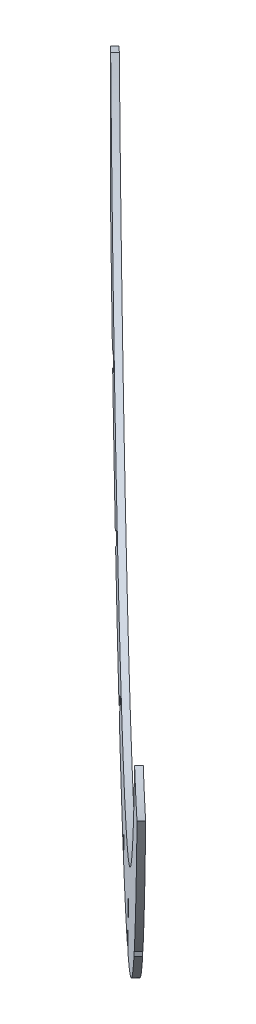
ISO-10303-21;
HEADER;
FILE_DESCRIPTION(('STEP AP214'),'2;1');
FILE_NAME('part.step','',(''),(''),'','','');
FILE_SCHEMA(('AUTOMOTIVE_DESIGN { 1 0 10303 214 1 1 1 1 }'));
ENDSEC;
DATA;
#1=APPLICATION_CONTEXT('core data for automotive mechanical design processes');
#2=APPLICATION_PROTOCOL_DEFINITION('international standard','automotive_design',2000,#1);
#3=PRODUCT_CONTEXT('',#1,'mechanical');
#4=PRODUCT('Part','Part','',(#3));
#5=PRODUCT_RELATED_PRODUCT_CATEGORY('part','',(#4));
#6=PRODUCT_DEFINITION_FORMATION('','',#4);
#7=PRODUCT_DEFINITION_CONTEXT('part definition',#1,'design');
#8=PRODUCT_DEFINITION('design','',#6,#7);
#9=PRODUCT_DEFINITION_SHAPE('','',#8);
#10=(LENGTH_UNIT() NAMED_UNIT(*) SI_UNIT(.MILLI.,.METRE.));
#11=(NAMED_UNIT(*) PLANE_ANGLE_UNIT() SI_UNIT($,.RADIAN.));
#12=(NAMED_UNIT(*) SI_UNIT($,.STERADIAN.) SOLID_ANGLE_UNIT());
#13=UNCERTAINTY_MEASURE_WITH_UNIT(LENGTH_MEASURE(1.E-05),#10,'distance_accuracy_value','');
#14=(GEOMETRIC_REPRESENTATION_CONTEXT(3) GLOBAL_UNCERTAINTY_ASSIGNED_CONTEXT((#13)) GLOBAL_UNIT_ASSIGNED_CONTEXT((#10,
#11,#12)) REPRESENTATION_CONTEXT('',''));
#15=CARTESIAN_POINT('',(0.,0.,0.));
#16=DIRECTION('',(0.,0.,1.));
#17=DIRECTION('',(1.,0.,0.));
#18=AXIS2_PLACEMENT_3D('',#15,#16,#17);
#19=CARTESIAN_POINT('',(-161.990390566707,0.,168.265005002207));
#20=DIRECTION('',(-0.693547097638021,0.,0.720411287639136));
#21=DIRECTION('',(0.720411287639136,0.,0.693547097638021));
#22=AXIS2_PLACEMENT_3D('',#19,#20,#21);
#23=PLANE('',#22);
#24=DIRECTION('',(0.,1.,0.));
#25=VECTOR('',#24,1.);
#26=CARTESIAN_POINT('',(-334.662345491773,0.,2.03200000000001));
#27=LINE('',#26,#25);
#28=CARTESIAN_POINT('',(-334.662345491773,-173.506150768829,2.03200000000003));
#29=VERTEX_POINT('',#28);
#30=CARTESIAN_POINT('',(-334.662345491773,-109.465312352597,2.03200000000001));
#31=VERTEX_POINT('',#30);
#32=EDGE_CURVE('E250',#29,#31,#27,.T.);
#33=ORIENTED_EDGE('',*,*,#32,.T.);
#34=DIRECTION('',(0.701450777031491,0.227915173395406,0.675293625868081));
#35=VECTOR('',#34,1.);
#36=CARTESIAN_POINT('',(-153.459532495777,-50.5889493973902,176.477746747058));
#37=LINE('',#36,#35);
#38=CARTESIAN_POINT('',(-330.156120633245,-108.001151140407,6.37018740150313));
#39=VERTEX_POINT('',#38);
#40=EDGE_CURVE('E45',#31,#39,#37,.T.);
#41=ORIENTED_EDGE('',*,*,#40,.T.);
#42=CARTESIAN_POINT('',(-161.990390566707,0.,168.265005002207));
#43=DIRECTION('',(-0.693547097638021,0.,0.720411287639136));
#44=DIRECTION('',(0.720411287639136,0.,0.693547097638021));
#45=AXIS2_PLACEMENT_3D('',#42,#43,#44);
#46=CIRCLE('',#45,257.203991770015);
#47=CARTESIAN_POINT('',(8.28892702871723,-101.419609224618,332.194594297101));
#48=VERTEX_POINT('',#47);
#49=EDGE_CURVE('E241',#39,#48,#46,.T.);
#50=ORIENTED_EDGE('',*,*,#49,.T.);
#51=CARTESIAN_POINT('',(2.23724422756069,0.,326.368579193531));
#52=DIRECTION('',(-0.693547097638021,0.,0.720411287639136));
#53=DIRECTION('',(-0.720411287639136,0.,-0.693547097638021));
#54=AXIS2_PLACEMENT_3D('',#51,#52,#53);
#55=ELLIPSE('',#54,141.030549830714,101.6);
#56=CARTESIAN_POINT('',(42.2400086222768,-93.3934625162856,364.879637556278));
#57=VERTEX_POINT('',#56);
#58=EDGE_CURVE('E344',#57,#48,#55,.F.);
#59=ORIENTED_EDGE('',*,*,#58,.F.);
#60=CARTESIAN_POINT('',(-161.990390566707,0.,168.265005002207));
#61=DIRECTION('',(-0.693547097638021,0.,0.720411287639136));
#62=DIRECTION('',(0.720411287639136,0.,0.693547097638021));
#63=AXIS2_PLACEMENT_3D('',#60,#61,#62);
#64=CIRCLE('',#63,298.478991770015);
#65=CARTESIAN_POINT('',(2.87453446913316,-191.619798668164,326.982104835035));
#66=VERTEX_POINT('',#65);
#67=EDGE_CURVE('E829',#66,#57,#64,.T.);
#68=ORIENTED_EDGE('',*,*,#67,.F.);
#69=DIRECTION('',(0.,1.,0.));
#70=VECTOR('',#69,1.);
#71=CARTESIAN_POINT('',(2.87453446913319,0.,326.982104835035));
#72=LINE('',#71,#70);
#73=CARTESIAN_POINT('',(2.87453446913319,-152.657080758462,326.982104835035));
#74=VERTEX_POINT('',#73);
#75=EDGE_CURVE('E689',#66,#74,#72,.T.);
#76=ORIENTED_EDGE('',*,*,#75,.T.);
#77=DIRECTION('',(-0.46940785733499,-0.758577218478036,-0.451903603745643));
#78=VECTOR('',#77,1.);
#79=CARTESIAN_POINT('',(-12.7621626909497,-177.926453762191,311.928501264275));
#80=LINE('',#79,#78);
#81=CARTESIAN_POINT('',(-0.637290241572108,-158.332295135899,323.601236326568));
#82=VERTEX_POINT('',#81);
#83=EDGE_CURVE('E693',#74,#82,#80,.T.);
#84=ORIENTED_EDGE('',*,*,#83,.T.);
#85=DIRECTION('',(0.,-1.,0.));
#86=VECTOR('',#85,1.);
#87=CARTESIAN_POINT('',(-0.637290241572053,0.,323.601236326568));
#88=LINE('',#87,#86);
#89=CARTESIAN_POINT('',(-0.637290241572025,-197.295567059821,323.601236326568));
#90=VERTEX_POINT('',#89);
#91=EDGE_CURVE('E695',#82,#90,#88,.T.);
#92=ORIENTED_EDGE('',*,*,#91,.T.);
#93=CARTESIAN_POINT('',(-88.5845045240809,-280.548100883959,238.933580145233));
#94=VERTEX_POINT('',#93);
#95=EDGE_CURVE('E831',#94,#90,#64,.T.);
#96=ORIENTED_EDGE('',*,*,#95,.F.);
#97=DIRECTION('',(-0.296188126760783,-0.911573321638448,-0.285143249688616));
#98=VECTOR('',#97,1.);
#99=CARTESIAN_POINT('',(-25.2454007122821,-85.6103838229504,299.910764108612));
#100=LINE('',#99,#98);
#101=CARTESIAN_POINT('',(-78.1700446466156,-248.495689170512,248.959684046456));
#102=VERTEX_POINT('',#101);
#103=EDGE_CURVE('E713',#102,#94,#100,.T.);
#104=ORIENTED_EDGE('',*,*,#103,.F.);
#105=DIRECTION('',(0.679204873038526,0.333354543896063,0.65387727327425));
#106=VECTOR('',#105,1.);
#107=CARTESIAN_POINT('',(-96.412425929923,-257.449071181848,231.397562505432));
#108=LINE('',#107,#106);
#109=CARTESIAN_POINT('',(-81.6261467469088,-250.191948112453,245.632460248153));
#110=VERTEX_POINT('',#109);
#111=EDGE_CURVE('E711',#110,#102,#108,.T.);
#112=ORIENTED_EDGE('',*,*,#111,.F.);
#113=DIRECTION('',(0.296188126760783,0.911573321638448,0.285143249688616));
#114=VECTOR('',#113,1.);
#115=CARTESIAN_POINT('',(-27.6593186206254,-84.0991296346225,297.586861376946));
#116=LINE('',#115,#114);
#117=CARTESIAN_POINT('',(-92.0406066243741,-282.2443598259,235.606356346931));
#118=VERTEX_POINT('',#117);
#119=EDGE_CURVE('E709',#118,#110,#116,.T.);
#120=ORIENTED_EDGE('',*,*,#119,.F.);
#121=CARTESIAN_POINT('',(-148.869926078573,-297.922833449937,180.896206402768));
#122=VERTEX_POINT('',#121);
#123=EDGE_CURVE('E258',#122,#118,#64,.T.);
#124=ORIENTED_EDGE('',*,*,#123,.F.);
#125=DIRECTION('',(-0.415993734480624,-0.816433673516012,-0.40048129746845));
#126=VECTOR('',#125,1.);
#127=CARTESIAN_POINT('',(-52.060844940478,-107.924313780006,274.095269771639));
#128=LINE('',#127,#126);
#129=CARTESIAN_POINT('',(-138.551072224335,-277.670942470836,190.830269436415));
#130=VERTEX_POINT('',#129);
#131=EDGE_CURVE('E678',#130,#122,#128,.T.);
#132=ORIENTED_EDGE('',*,*,#131,.F.);
#133=DIRECTION('',(0.588168034009613,-0.577439223424566,0.566235204680971));
#134=VECTOR('',#133,1.);
#135=CARTESIAN_POINT('',(-248.480617850565,-169.746628690825,85.0000046669825));
#136=LINE('',#135,#134);
#137=CARTESIAN_POINT('',(-140.964990132678,-275.301056992868,188.506366704749));
#138=VERTEX_POINT('',#137);
#139=EDGE_CURVE('E676',#138,#130,#136,.T.);
#140=ORIENTED_EDGE('',*,*,#139,.F.);
#141=DIRECTION('',(0.415993734480622,0.816433673516014,0.400481297468449));
#142=VECTOR('',#141,1.);
#143=CARTESIAN_POINT('',(-54.4747628488212,-105.554428302037,271.771367039973));
#144=LINE('',#143,#142);
#145=CARTESIAN_POINT('',(-152.63059266156,-298.1960910691,177.275775353774));
#146=VERTEX_POINT('',#145);
#147=EDGE_CURVE('E674',#146,#138,#144,.T.);
#148=ORIENTED_EDGE('',*,*,#147,.F.);
#149=CARTESIAN_POINT('',(-208.230950592468,-291.49583696271,123.748758867142));
#150=VERTEX_POINT('',#149);
#151=EDGE_CURVE('E257',#150,#146,#64,.T.);
#152=ORIENTED_EDGE('',*,*,#151,.F.);
#153=DIRECTION('',(-0.511561649630656,-0.704104205758047,-0.49248547802041));
#154=VECTOR('',#153,1.);
#155=CARTESIAN_POINT('',(-79.9200617798868,-114.891049401486,247.274925181038));
#156=LINE('',#155,#154);
#157=CARTESIAN_POINT('',(-192.861249167201,-270.341257797934,138.54532299371));
#158=VERTEX_POINT('',#157);
#159=EDGE_CURVE('E730',#158,#150,#156,.T.);
#160=ORIENTED_EDGE('',*,*,#159,.F.);
#161=DIRECTION('',(0.702064563395524,-0.224244194830839,0.67588452409337));
#162=VECTOR('',#161,1.);
#163=CARTESIAN_POINT('',(-206.103625144743,-266.111552876824,125.796756192165));
#164=LINE('',#163,#162);
#165=CARTESIAN_POINT('',(-196.813239168247,-269.078965322328,134.740702991015));
#166=VERTEX_POINT('',#165);
#167=EDGE_CURVE('E728',#166,#158,#164,.T.);
#168=ORIENTED_EDGE('',*,*,#167,.F.);
#169=DIRECTION('',(0.511561649630656,0.704104205758047,0.492485478020411));
#170=VECTOR('',#169,1.);
#171=CARTESIAN_POINT('',(-82.3339796882299,-111.511782305104,244.951022449372));
#172=LINE('',#171,#170);
#173=CARTESIAN_POINT('',(-212.182940593513,-290.233544487104,119.944138864446));
#174=VERTEX_POINT('',#173);
#175=EDGE_CURVE('E726',#174,#166,#172,.T.);
#176=ORIENTED_EDGE('',*,*,#175,.F.);
#177=CARTESIAN_POINT('',(-260.035404079115,-265.64566239674,73.8760972683336));
#178=VERTEX_POINT('',#177);
#179=EDGE_CURVE('E253',#178,#174,#64,.T.);
#180=ORIENTED_EDGE('',*,*,#179,.F.);
#181=CARTESIAN_POINT('',(-260.035404079115,-265.64566239674,73.8760972683336));
#182=CARTESIAN_POINT('',(-261.993265554872,-264.25332744598,71.9912445912772));
#183=CARTESIAN_POINT('',(-263.921450708035,-262.790832152815,70.1349616045577));
#184=CARTESIAN_POINT('',(-267.731917031048,-259.757316017976,66.4665878515123));
#185=CARTESIAN_POINT('',(-269.613974484562,-258.185766269304,64.6547124591236));
#186=CARTESIAN_POINT('',(-273.338171583193,-254.948293653579,61.0693909447262));
#187=CARTESIAN_POINT('',(-275.182185242131,-253.280304754892,59.2941406910097));
#188=CARTESIAN_POINT('',(-278.819523708239,-249.871314445755,55.7924388443283));
#189=CARTESIAN_POINT('',(-280.613835541035,-248.129506052597,54.065037031995));
#190=CARTESIAN_POINT('',(-285.928928522884,-242.80015254008,48.9481442590932));
#191=CARTESIAN_POINT('',(-289.382194306866,-239.109180252853,45.6236510106572));
#192=CARTESIAN_POINT('',(-296.122656445807,-231.472832985096,39.134541201563));
#193=CARTESIAN_POINT('',(-299.409636530406,-227.527126698785,35.9701328465261));
#194=CARTESIAN_POINT('',(-309.028473812187,-215.319128933962,26.7099827157676));
#195=CARTESIAN_POINT('',(-315.119665775329,-206.688161028464,20.8459317497741));
#196=CARTESIAN_POINT('',(-322.323719904928,-195.271468149337,13.9105173295138));
#197=CARTESIAN_POINT('',(-323.743904380823,-192.956531951781,12.5432916373742));
#198=CARTESIAN_POINT('',(-326.542332377386,-188.262409971226,9.8492172270114));
#199=CARTESIAN_POINT('',(-327.919198367047,-185.885421736105,8.52369467156158));
#200=CARTESIAN_POINT('',(-331.972185603889,-178.681435362112,4.62184362743451));
#201=CARTESIAN_POINT('',(-334.574810331148,-173.774773788733,2.11627096803516));
#202=CARTESIAN_POINT('',(-337.076263400116,-168.762219099896,-0.291902731666294));
#203=B_SPLINE_CURVE_WITH_KNOTS('',3,(#181,#182,#183,#184,#185,#186,#187,#188,#189,#190,#191,
#192,#193,#194,#195,#196,#197,#198,#199,#200,#201,#202),.UNSPECIFIED.,.F.,.F.,(4,2,2,2,2,2,2,2,
2,2,4),(0.,0.0625000000000001,0.125,0.1875,0.25,0.375,0.5,0.75,0.8125,0.875,1.),.UNSPECIFIED.);
#204=CARTESIAN_POINT('',(-260.594458535349,-265.245620671256,73.3378899939679));
#205=VERTEX_POINT('',#204);
#206=EDGE_CURVE('E315',#178,#205,#203,.T.);
#207=ORIENTED_EDGE('',*,*,#206,.T.);
#208=DIRECTION('',(-0.584524481123475,-0.584524481123477,-0.562727520150439));
#209=VECTOR('',#208,1.);
#210=CARTESIAN_POINT('',(-105.054159720957,-109.705321856863,223.07807960425));
#211=LINE('',#210,#209);
#212=CARTESIAN_POINT('',(-247.793686502974,-252.44484863888,85.6613202940036));
#213=VERTEX_POINT('',#212);
#214=EDGE_CURVE('E53',#213,#205,#211,.T.);
#215=ORIENTED_EDGE('',*,*,#214,.F.);
#216=DIRECTION('',(0.421098034102761,-0.811376072464139,0.405395257381557));
#217=VECTOR('',#216,1.);
#218=CARTESIAN_POINT('',(-304.729917348723,-142.739526782017,30.8482456919604));
#219=LINE('',#218,#217);
#220=CARTESIAN_POINT('',(-250.207604411317,-247.793686502976,83.3374175623373));
#221=VERTEX_POINT('',#220);
#222=EDGE_CURVE('E654',#221,#213,#219,.T.);
#223=ORIENTED_EDGE('',*,*,#222,.F.);
#224=DIRECTION('',(0.584524481123473,0.584524481123481,0.562727520150437));
#225=VECTOR('',#224,1.);
#226=CARTESIAN_POINT('',(-107.4680776293,-105.054159720958,220.754176872584));
#227=LINE('',#226,#225);
#228=CARTESIAN_POINT('',(-264.63055613693,-262.21663822859,69.4522987693585));
#229=VERTEX_POINT('',#228);
#230=EDGE_CURVE('E659',#229,#221,#227,.T.);
#231=ORIENTED_EDGE('',*,*,#230,.F.);
#232=CARTESIAN_POINT('',(-301.964943469043,-224.280894681706,33.5101134919233));
#233=VERTEX_POINT('',#232);
#234=EDGE_CURVE('E320',#229,#233,#203,.T.);
#235=ORIENTED_EDGE('',*,*,#234,.T.);
#236=DIRECTION('',(0.638267967412966,0.463728822589062,0.614466907875992));
#237=VECTOR('',#236,1.);
#238=CARTESIAN_POINT('',(-125.707748437116,-96.2225466240742,203.194664733222));
#239=LINE('',#238,#237);
#240=CARTESIAN_POINT('',(-289.067771099043,-214.910550463884,45.9263493538916));
#241=VERTEX_POINT('',#240);
#242=EDGE_CURVE('E747',#233,#241,#239,.T.);
#243=ORIENTED_EDGE('',*,*,#242,.T.);
#244=DIRECTION('',(-0.52778991266738,0.680634608990476,-0.50810858793268));
#245=VECTOR('',#244,1.);
#246=CARTESIAN_POINT('',(-298.063463189134,-203.309761548852,37.2661072847069));
#247=LINE('',#246,#245);
#248=CARTESIAN_POINT('',(-293.112928811499,-209.693940081909,42.0320358706091));
#249=VERTEX_POINT('',#248);
#250=EDGE_CURVE('E354',#241,#249,#247,.T.);
#251=ORIENTED_EDGE('',*,*,#250,.T.);
#252=DIRECTION('',(-0.638267967412967,-0.463728822589061,-0.614466907875992));
#253=VECTOR('',#252,1.);
#254=CARTESIAN_POINT('',(-128.121666345459,-89.8207711510365,200.870762001555));
#255=LINE('',#254,#253);
#256=CARTESIAN_POINT('',(-306.010101181499,-219.064284299731,29.6158000086408));
#257=VERTEX_POINT('',#256);
#258=EDGE_CURVE('E740',#249,#257,#255,.T.);
#259=ORIENTED_EDGE('',*,*,#258,.T.);
#260=EDGE_CURVE('E311',#257,#29,#203,.T.);
#261=ORIENTED_EDGE('',*,*,#260,.T.);
#262=EDGE_LOOP('',(#33,#41,#50,#59,#68,#76,#84,#92,#96,#104,#112,#120,#124,#132,#140,#148,#152,
#160,#168,#176,#180,#207,#215,#223,#231,#235,#243,#251,#259,#261));
#263=FACE_BOUND('',#262,.T.);
#264=ADVANCED_FACE('F30',(#263),#23,.F.);
#265=CARTESIAN_POINT('',(-164.227634794267,0.,170.588907733874));
#266=DIRECTION('',(-0.693547097638021,0.,0.720411287639136));
#267=DIRECTION('',(0.720411287639136,0.,0.693547097638021));
#268=AXIS2_PLACEMENT_3D('',#265,#266,#267);
#269=PLANE('',#268);
#270=DIRECTION('',(-0.701450777031493,-0.227915173395406,-0.675293625868079));
#271=VECTOR('',#270,1.);
#272=CARTESIAN_POINT('',(-332.393364860805,-108.001151140407,8.69409013316944));
#273=LINE('',#272,#271);
#274=CARTESIAN_POINT('',(-332.393364860805,-108.001151140407,8.69409013316944));
#275=VERTEX_POINT('',#274);
#276=CARTESIAN_POINT('',(-336.899589719254,-109.465312352571,4.35590273174369));
#277=VERTEX_POINT('',#276);
#278=EDGE_CURVE('E225',#275,#277,#273,.T.);
#279=ORIENTED_EDGE('',*,*,#278,.T.);
#280=DIRECTION('',(0.,1.,0.));
#281=VECTOR('',#280,1.);
#282=CARTESIAN_POINT('',(-336.899589719334,0.,4.35590273166633));
#283=LINE('',#282,#281);
#284=CARTESIAN_POINT('',(-336.899589719254,-173.506207682169,4.35590273174369));
#285=VERTEX_POINT('',#284);
#286=EDGE_CURVE('E312',#285,#277,#283,.T.);
#287=ORIENTED_EDGE('',*,*,#286,.F.);
#288=CARTESIAN_POINT('',(-308.247322156619,-219.064314996657,31.9397251256635));
#289=CARTESIAN_POINT('',(-313.424072547645,-212.230180717741,26.9560161381795));
#290=CARTESIAN_POINT('',(-318.382901482381,-205.062211333023,22.1821022998213));
#291=CARTESIAN_POINT('',(-324.560964132489,-195.271468149337,16.2344200611801));
#292=CARTESIAN_POINT('',(-325.981148608384,-192.956531951781,14.8671943690405));
#293=CARTESIAN_POINT('',(-328.779576604946,-188.262409971226,12.1731199586777));
#294=CARTESIAN_POINT('',(-330.156442594608,-185.885421736105,10.8475974032279));
#295=CARTESIAN_POINT('',(-333.351272190649,-180.206768552129,7.77190323824128));
#296=CARTESIAN_POINT('',(-335.148834202088,-176.881012916276,6.04137244666617));
#297=CARTESIAN_POINT('',(-336.899550832575,-173.506225729318,4.35594016833493));
#298=B_SPLINE_CURVE_WITH_KNOTS('',3,(#288,#289,#290,#291,#292,#293,#294,#295,#296,#297),
.UNSPECIFIED.,.F.,.F.,(4,2,2,2,4),(0.544505820135891,0.75,0.8125,0.875,0.960299762064982),.UNSPECIFIED.);
#299=CARTESIAN_POINT('',(-308.247301318649,-219.064252272258,31.9397451865843));
#300=VERTEX_POINT('',#299);
#301=EDGE_CURVE('E319',#300,#285,#298,.T.);
#302=ORIENTED_EDGE('',*,*,#301,.F.);
#303=DIRECTION('',(-0.638267967412967,-0.463728822589061,-0.614466907875992));
#304=VECTOR('',#303,1.);
#305=CARTESIAN_POINT('',(-130.358910573019,-89.8207711510364,203.194664733222));
#306=LINE('',#305,#304);
#307=CARTESIAN_POINT('',(-295.350173039059,-209.693940081909,44.3559386022755));
#308=VERTEX_POINT('',#307);
#309=EDGE_CURVE('E738',#308,#300,#306,.T.);
#310=ORIENTED_EDGE('',*,*,#309,.F.);
#311=DIRECTION('',(-0.52778991266738,0.680634608990476,-0.50810858793268));
#312=VECTOR('',#311,1.);
#313=CARTESIAN_POINT('',(-300.300707416695,-203.309761548852,39.5900100163732));
#314=LINE('',#313,#312);
#315=CARTESIAN_POINT('',(-291.305015326603,-214.910550463884,48.2502520855579));
#316=VERTEX_POINT('',#315);
#317=EDGE_CURVE('E759',#316,#308,#314,.T.);
#318=ORIENTED_EDGE('',*,*,#317,.F.);
#319=DIRECTION('',(0.638267967412966,0.463728822589062,0.614466907875992));
#320=VECTOR('',#319,1.);
#321=CARTESIAN_POINT('',(-127.944992664676,-96.2225466240742,205.518567464888));
#322=LINE('',#321,#320);
#323=CARTESIAN_POINT('',(-304.202187696604,-224.280894681706,35.8340162235904));
#324=VERTEX_POINT('',#323);
#325=EDGE_CURVE('E745',#324,#316,#322,.T.);
#326=ORIENTED_EDGE('',*,*,#325,.F.);
#327=CARTESIAN_POINT('',(-266.86779282373,-262.216644108918,71.7762087605897));
#328=CARTESIAN_POINT('',(-267.267545390256,-261.904914766376,71.3913629967265));
#329=CARTESIAN_POINT('',(-267.666236762526,-261.590676563375,71.007538855107));
#330=CARTESIAN_POINT('',(-269.969161258609,-259.757316017976,68.7904905831786));
#331=CARTESIAN_POINT('',(-271.851218712123,-258.185766269304,66.9786151907899));
#332=CARTESIAN_POINT('',(-275.575415810753,-254.948293653579,63.3932936763925));
#333=CARTESIAN_POINT('',(-277.419429469692,-253.280304754892,61.618043422676));
#334=CARTESIAN_POINT('',(-281.056767935799,-249.871314445755,58.1163415759946));
#335=CARTESIAN_POINT('',(-282.851079768595,-248.129506052597,56.3889397636613));
#336=CARTESIAN_POINT('',(-288.166172750444,-242.80015254008,51.2720469907595));
#337=CARTESIAN_POINT('',(-291.619438534426,-239.109180252853,47.9475537423235));
#338=CARTESIAN_POINT('',(-298.132201689126,-231.730795789476,41.6776520055696));
#339=CARTESIAN_POINT('',(-301.202351960002,-228.059702851055,38.7219878645255));
#340=CARTESIAN_POINT('',(-304.202187696604,-224.280894681706,35.8340162235901));
#341=B_SPLINE_CURVE_WITH_KNOTS('',3,(#327,#328,#329,#330,#331,#332,#333,#334,#335,#336,#337,
#338,#339,#340),.UNSPECIFIED.,.F.,.F.,(4,2,2,2,2,2,4),(0.0494539807970804,0.0625000000000001,
0.125,0.1875,0.25,0.375,0.491554771039893),.UNSPECIFIED.);
#342=CARTESIAN_POINT('',(-266.867792032345,-262.216629896086,71.7762095224643));
#343=VERTEX_POINT('',#342);
#344=EDGE_CURVE('E326',#343,#324,#341,.T.);
#345=ORIENTED_EDGE('',*,*,#344,.F.);
#346=DIRECTION('',(0.584524481123473,0.584524481123481,0.562727520150437));
#347=VECTOR('',#346,1.);
#348=CARTESIAN_POINT('',(-109.705321856861,-105.054159720958,223.07807960425));
#349=LINE('',#348,#347);
#350=CARTESIAN_POINT('',(-252.444848638878,-247.793686502976,85.6613202940035));
#351=VERTEX_POINT('',#350);
#352=EDGE_CURVE('E814',#343,#351,#349,.T.);
#353=ORIENTED_EDGE('',*,*,#352,.T.);
#354=DIRECTION('',(0.421098034102761,-0.811376072464139,0.405395257381557));
#355=VECTOR('',#354,1.);
#356=CARTESIAN_POINT('',(-306.967161576284,-142.739526782017,33.1721484236267));
#357=LINE('',#356,#355);
#358=CARTESIAN_POINT('',(-250.030930730534,-252.44484863888,87.9852230256699));
#359=VERTEX_POINT('',#358);
#360=EDGE_CURVE('E11',#351,#359,#357,.T.);
#361=ORIENTED_EDGE('',*,*,#360,.T.);
#362=DIRECTION('',(-0.584524481123475,-0.584524481123477,-0.562727520150439));
#363=VECTOR('',#362,1.);
#364=CARTESIAN_POINT('',(-107.291403948518,-109.705321856863,225.401982335917));
#365=LINE('',#364,#363);
#366=CARTESIAN_POINT('',(-262.831700223657,-265.245613876617,75.6617951701981));
#367=VERTEX_POINT('',#366);
#368=EDGE_CURVE('E655',#359,#367,#365,.T.);
#369=ORIENTED_EDGE('',*,*,#368,.T.);
#370=CARTESIAN_POINT('',(-262.272648306676,-265.64566239674,76.1999999999999));
#371=CARTESIAN_POINT('',(-262.459267474994,-265.512948007214,76.0203398742196));
#372=CARTESIAN_POINT('',(-262.645617019242,-265.379596176272,75.8409393182082));
#373=CARTESIAN_POINT('',(-262.831702762757,-265.245620671366,75.6617927257811));
#374=B_SPLINE_CURVE_WITH_KNOTS('',3,(#370,#371,#372,#373),.UNSPECIFIED.,.F.,.F.,(4,4),(0.,
0.0059573663225525),.UNSPECIFIED.);
#375=CARTESIAN_POINT('',(-262.272648306676,-265.64566239674,76.1999999999999));
#376=VERTEX_POINT('',#375);
#377=EDGE_CURVE('E263',#376,#367,#374,.T.);
#378=ORIENTED_EDGE('',*,*,#377,.F.);
#379=CARTESIAN_POINT('',(-164.227634794267,0.,170.588907733874));
#380=DIRECTION('',(-0.693547097638021,0.,0.720411287639136));
#381=DIRECTION('',(0.720411287639136,0.,0.693547097638021));
#382=AXIS2_PLACEMENT_3D('',#379,#380,#381);
#383=CIRCLE('',#382,298.478991770015);
#384=CARTESIAN_POINT('',(-214.420184821074,-290.233544487104,122.268041596113));
#385=VERTEX_POINT('',#384);
#386=EDGE_CURVE('E268',#376,#385,#383,.T.);
#387=ORIENTED_EDGE('',*,*,#386,.T.);
#388=DIRECTION('',(0.511561649630656,0.704104205758047,0.492485478020411));
#389=VECTOR('',#388,1.);
#390=CARTESIAN_POINT('',(-84.5712239157907,-111.511782305104,247.274925181038));
#391=LINE('',#390,#389);
#392=CARTESIAN_POINT('',(-199.050483395807,-269.078965322328,137.064605722681));
#393=VERTEX_POINT('',#392);
#394=EDGE_CURVE('E760',#385,#393,#391,.T.);
#395=ORIENTED_EDGE('',*,*,#394,.T.);
#396=DIRECTION('',(0.702064563395524,-0.224244194830839,0.67588452409337));
#397=VECTOR('',#396,1.);
#398=CARTESIAN_POINT('',(-208.340869372303,-266.111552876824,128.120658923831));
#399=LINE('',#398,#397);
#400=CARTESIAN_POINT('',(-195.098493394762,-270.341257797934,140.869225725377));
#401=VERTEX_POINT('',#400);
#402=EDGE_CURVE('E763',#393,#401,#399,.T.);
#403=ORIENTED_EDGE('',*,*,#402,.T.);
#404=DIRECTION('',(-0.511561649630656,-0.704104205758047,-0.49248547802041));
#405=VECTOR('',#404,1.);
#406=CARTESIAN_POINT('',(-82.1573060074475,-114.891049401486,249.598827912705));
#407=LINE('',#406,#405);
#408=CARTESIAN_POINT('',(-210.468194820029,-291.49583696271,126.072661598808));
#409=VERTEX_POINT('',#408);
#410=EDGE_CURVE('E848',#401,#409,#407,.T.);
#411=ORIENTED_EDGE('',*,*,#410,.T.);
#412=CARTESIAN_POINT('',(-154.867836889121,-298.1960910691,179.59967808544));
#413=VERTEX_POINT('',#412);
#414=EDGE_CURVE('E769',#409,#413,#383,.T.);
#415=ORIENTED_EDGE('',*,*,#414,.T.);
#416=DIRECTION('',(0.415993734480622,0.816433673516014,0.400481297468449));
#417=VECTOR('',#416,1.);
#418=CARTESIAN_POINT('',(-56.712007076382,-105.554428302037,274.095269771639));
#419=LINE('',#418,#417);
#420=CARTESIAN_POINT('',(-143.202234360239,-275.301056992868,190.830269436415));
#421=VERTEX_POINT('',#420);
#422=EDGE_CURVE('E796',#413,#421,#419,.T.);
#423=ORIENTED_EDGE('',*,*,#422,.T.);
#424=DIRECTION('',(0.588168034009613,-0.577439223424566,0.566235204680971));
#425=VECTOR('',#424,1.);
#426=CARTESIAN_POINT('',(-250.717862078125,-169.746628690825,87.3239073986488));
#427=LINE('',#426,#425);
#428=CARTESIAN_POINT('',(-140.788316451896,-277.670942470836,193.154172168082));
#429=VERTEX_POINT('',#428);
#430=EDGE_CURVE('E800',#421,#429,#427,.T.);
#431=ORIENTED_EDGE('',*,*,#430,.T.);
#432=DIRECTION('',(-0.415993734480624,-0.816433673516012,-0.40048129746845));
#433=VECTOR('',#432,1.);
#434=CARTESIAN_POINT('',(-54.2980891680387,-107.924313780006,276.419172503306));
#435=LINE('',#434,#433);
#436=CARTESIAN_POINT('',(-151.107170306134,-297.922833449937,183.220109134435));
#437=VERTEX_POINT('',#436);
#438=EDGE_CURVE('E803',#429,#437,#435,.T.);
#439=ORIENTED_EDGE('',*,*,#438,.T.);
#440=CARTESIAN_POINT('',(-94.2778508519348,-282.2443598259,237.930259078597));
#441=VERTEX_POINT('',#440);
#442=EDGE_CURVE('E771',#437,#441,#383,.T.);
#443=ORIENTED_EDGE('',*,*,#442,.T.);
#444=DIRECTION('',(0.296188126760783,0.911573321638448,0.285143249688616));
#445=VECTOR('',#444,1.);
#446=CARTESIAN_POINT('',(-29.8965628481861,-84.0991296346225,299.910764108612));
#447=LINE('',#446,#445);
#448=CARTESIAN_POINT('',(-83.8633909744696,-250.191948112453,247.956362979819));
#449=VERTEX_POINT('',#448);
#450=EDGE_CURVE('E851',#441,#449,#447,.T.);
#451=ORIENTED_EDGE('',*,*,#450,.T.);
#452=DIRECTION('',(0.679204873038526,0.333354543896063,0.65387727327425));
#453=VECTOR('',#452,1.);
#454=CARTESIAN_POINT('',(-98.6496701574837,-257.449071181848,233.721465237099));
#455=LINE('',#454,#453);
#456=CARTESIAN_POINT('',(-80.4072888741763,-248.495689170512,251.283586778122));
#457=VERTEX_POINT('',#456);
#458=EDGE_CURVE('E853',#449,#457,#455,.T.);
#459=ORIENTED_EDGE('',*,*,#458,.T.);
#460=DIRECTION('',(-0.296188126760783,-0.911573321638448,-0.285143249688616));
#461=VECTOR('',#460,1.);
#462=CARTESIAN_POINT('',(-27.4826449398428,-85.6103838229504,302.234666840279));
#463=LINE('',#462,#461);
#464=CARTESIAN_POINT('',(-90.8217487516415,-280.548100883959,241.2574828769));
#465=VERTEX_POINT('',#464);
#466=EDGE_CURVE('E786',#457,#465,#463,.T.);
#467=ORIENTED_EDGE('',*,*,#466,.T.);
#468=CARTESIAN_POINT('',(-2.87453446913277,-197.295567059821,325.925139058234));
#469=VERTEX_POINT('',#468);
#470=EDGE_CURVE('E780',#465,#469,#383,.T.);
#471=ORIENTED_EDGE('',*,*,#470,.T.);
#472=DIRECTION('',(0.,-1.,0.));
#473=VECTOR('',#472,1.);
#474=CARTESIAN_POINT('',(-2.8745344691328,0.,325.925139058234));
#475=LINE('',#474,#473);
#476=CARTESIAN_POINT('',(-2.87453446913283,-158.332295135899,325.925139058234));
#477=VERTEX_POINT('',#476);
#478=EDGE_CURVE('E794',#477,#469,#475,.T.);
#479=ORIENTED_EDGE('',*,*,#478,.F.);
#480=DIRECTION('',(-0.46940785733499,-0.758577218478036,-0.451903603745643));
#481=VECTOR('',#480,1.);
#482=CARTESIAN_POINT('',(-14.9994069185104,-177.926453762191,314.252403995941));
#483=LINE('',#482,#481);
#484=CARTESIAN_POINT('',(0.637290241572497,-152.657080758462,329.306007566701));
#485=VERTEX_POINT('',#484);
#486=EDGE_CURVE('E791',#485,#477,#483,.T.);
#487=ORIENTED_EDGE('',*,*,#486,.F.);
#488=DIRECTION('',(0.,1.,0.));
#489=VECTOR('',#488,1.);
#490=CARTESIAN_POINT('',(0.637290241572441,0.,329.306007566701));
#491=LINE('',#490,#489);
#492=CARTESIAN_POINT('',(0.637290241572441,-191.619798668164,329.306007566701));
#493=VERTEX_POINT('',#492);
#494=EDGE_CURVE('E788',#493,#485,#491,.T.);
#495=ORIENTED_EDGE('',*,*,#494,.F.);
#496=CARTESIAN_POINT('',(40.0027643947161,-93.3934625162856,367.203540287945));
#497=VERTEX_POINT('',#496);
#498=EDGE_CURVE('E248',#493,#497,#383,.T.);
#499=ORIENTED_EDGE('',*,*,#498,.T.);
#500=CARTESIAN_POINT('',(0.,0.,328.692481925197));
#501=DIRECTION('',(-0.693547097638021,0.,0.720411287639136));
#502=DIRECTION('',(-0.720411287639136,0.,-0.693547097638021));
#503=AXIS2_PLACEMENT_3D('',#500,#501,#502);
#504=ELLIPSE('',#503,141.030549830714,101.6);
#505=CARTESIAN_POINT('',(6.05168280115652,-101.419609224618,334.518497028767));
#506=VERTEX_POINT('',#505);
#507=EDGE_CURVE('E246',#497,#506,#504,.F.);
#508=ORIENTED_EDGE('',*,*,#507,.T.);
#509=CARTESIAN_POINT('',(-164.227634794267,0.,170.588907733874));
#510=DIRECTION('',(-0.693547097638021,0.,0.720411287639136));
#511=DIRECTION('',(0.720411287639136,0.,0.693547097638021));
#512=AXIS2_PLACEMENT_3D('',#509,#510,#511);
#513=CIRCLE('',#512,257.203991770015);
#514=EDGE_CURVE('E239',#275,#506,#513,.T.);
#515=ORIENTED_EDGE('',*,*,#514,.F.);
#516=EDGE_LOOP('',(#279,#287,#302,#310,#318,#326,#345,#353,#361,#369,#378,#387,#395,#403,#411,
#415,#423,#431,#439,#443,#451,#459,#467,#471,#479,#487,#495,#499,#508,#515));
#517=FACE_BOUND('',#516,.T.);
#518=ADVANCED_FACE('F244',(#517),#269,.T.);
#519=CARTESIAN_POINT('',(-78.6165835414838,-265.64566239674,-114.569887943909));
#520=CARTESIAN_POINT('',(-80.5744450172404,-264.25332744598,-116.454740620966));
#521=CARTESIAN_POINT('',(-82.5026301704038,-262.790832152815,-118.311023607685));
#522=CARTESIAN_POINT('',(-86.3130964934168,-259.757316017976,-121.979397360731));
#523=CARTESIAN_POINT('',(-88.1951539469304,-258.185766269304,-123.791272753119));
#524=CARTESIAN_POINT('',(-91.9193510455613,-254.948293653579,-127.376594267517));
#525=CARTESIAN_POINT('',(-93.7633647044997,-253.280304754892,-129.151844521233));
#526=CARTESIAN_POINT('',(-97.4007031706073,-249.871314445755,-132.653546367915));
#527=CARTESIAN_POINT('',(-99.1950150034033,-248.129506052597,-134.380948180248));
#528=CARTESIAN_POINT('',(-104.510107985252,-242.80015254008,-139.49784095315));
#529=CARTESIAN_POINT('',(-107.963373769234,-239.109180252853,-142.822334201586));
#530=CARTESIAN_POINT('',(-114.703835908175,-231.472832985096,-149.31144401068));
#531=CARTESIAN_POINT('',(-117.990815992775,-227.527126698785,-152.475852365717));
#532=CARTESIAN_POINT('',(-127.609653274556,-215.319128933962,-161.736002496475));
#533=CARTESIAN_POINT('',(-133.700845237697,-206.688161028464,-167.600053462469));
#534=CARTESIAN_POINT('',(-140.904899367296,-195.271468149337,-174.535467882729));
#535=CARTESIAN_POINT('',(-142.325083843191,-192.956531951781,-175.902693574869));
#536=CARTESIAN_POINT('',(-145.123511839754,-188.262409971226,-178.596767985232));
#537=CARTESIAN_POINT('',(-146.500377829416,-185.885421736105,-179.922290540681));
#538=CARTESIAN_POINT('',(-150.553365066258,-178.681435362112,-183.824141584808));
#539=CARTESIAN_POINT('',(-153.155989793517,-173.774773788733,-186.329714244208));
#540=CARTESIAN_POINT('',(-155.657442862485,-168.762219099896,-188.737887943909));
#541=B_SPLINE_CURVE_WITH_KNOTS('',3,(#519,#520,#521,#522,#523,#524,#525,#526,#527,#528,#529,
#530,#531,#532,#533,#534,#535,#536,#537,#538,#539,#540),.UNSPECIFIED.,.F.,.F.,(4,2,2,2,2,2,2,2,
2,2,4),(0.,0.0625000000000001,0.125,0.1875,0.25,0.375,0.5,0.75,0.8125,0.875,1.),.UNSPECIFIED.);
#542=DIRECTION('',(-0.693547097638021,0.,0.720411287639136));
#543=VECTOR('',#542,1.);
#544=SURFACE_OF_LINEAR_EXTRUSION('',#541,#543);
#545=DIRECTION('',(-0.693547097638021,0.,0.720411287639136));
#546=VECTOR('',#545,1.);
#547=CARTESIAN_POINT('',(-261.713080649129,-265.245620671256,74.4998413598007));
#548=LINE('',#547,#546);
#549=EDGE_CURVE('E38',#205,#367,#548,.T.);
#550=ORIENTED_EDGE('',*,*,#549,.F.);
#551=ORIENTED_EDGE('',*,*,#206,.F.);
#552=DIRECTION('',(-0.693547097638021,0.,0.720411287639136));
#553=VECTOR('',#552,1.);
#554=CARTESIAN_POINT('',(-78.6165835414838,-265.64566239674,-114.569887943909));
#555=LINE('',#554,#553);
#556=EDGE_CURVE('E309',#178,#376,#555,.T.);
#557=ORIENTED_EDGE('',*,*,#556,.T.);
#558=ORIENTED_EDGE('',*,*,#377,.T.);
#559=EDGE_LOOP('',(#550,#551,#557,#558));
#560=FACE_BOUND('',#559,.T.);
#561=ADVANCED_FACE('F280',(#560),#544,.F.);
#562=DIRECTION('',(-0.693547097638021,0.,0.720411287639136));
#563=VECTOR('',#562,1.);
#564=CARTESIAN_POINT('',(-265.74917825071,-262.21663822859,70.6142501351914));
#565=LINE('',#564,#563);
#566=EDGE_CURVE('E647',#343,#229,#565,.F.);
#567=ORIENTED_EDGE('',*,*,#566,.F.);
#568=ORIENTED_EDGE('',*,*,#344,.T.);
#569=DIRECTION('',(-0.693547097638021,0.,0.720411287639136));
#570=VECTOR('',#569,1.);
#571=CARTESIAN_POINT('',(-303.083565582824,-224.280894681706,34.672064857757));
#572=LINE('',#571,#570);
#573=EDGE_CURVE('E756',#324,#233,#572,.F.);
#574=ORIENTED_EDGE('',*,*,#573,.T.);
#575=ORIENTED_EDGE('',*,*,#234,.F.);
#576=EDGE_LOOP('',(#567,#568,#574,#575));
#577=FACE_BOUND('',#576,.T.);
#578=ADVANCED_FACE('F293',(#577),#544,.F.);
#579=CARTESIAN_POINT('',(-161.990390566707,0.,168.265005002207));
#580=DIRECTION('',(-0.693547097638021,0.,0.720411287639136));
#581=DIRECTION('',(0.720411287639136,0.,0.693547097638021));
#582=AXIS2_PLACEMENT_3D('',#579,#580,#581);
#583=CYLINDRICAL_SURFACE('',#582,298.478991770015);
#584=ORIENTED_EDGE('',*,*,#442,.F.);
#585=DIRECTION('',(0.693547097638021,0.,-0.720411287639136));
#586=VECTOR('',#585,1.);
#587=CARTESIAN_POINT('',(-640.908669608186,-297.922833449937,691.993817511968));
#588=LINE('',#587,#586);
#589=EDGE_CURVE('E671',#437,#122,#588,.T.);
#590=ORIENTED_EDGE('',*,*,#589,.T.);
#591=ORIENTED_EDGE('',*,*,#123,.T.);
#592=DIRECTION('',(0.693547097638021,0.,-0.720411287639136));
#593=VECTOR('',#592,1.);
#594=CARTESIAN_POINT('',(-586.875905438438,-282.2443598259,749.608845870713));
#595=LINE('',#594,#593);
#596=EDGE_CURVE('E698',#441,#118,#595,.T.);
#597=ORIENTED_EDGE('',*,*,#596,.F.);
#598=EDGE_LOOP('',(#584,#590,#591,#597));
#599=FACE_BOUND('',#598,.T.);
#600=ADVANCED_FACE('F549',(#599),#583,.T.);
#601=ORIENTED_EDGE('',*,*,#151,.T.);
#602=DIRECTION('',(0.693547097638021,0.,-0.720411287639136));
#603=VECTOR('',#602,1.);
#604=CARTESIAN_POINT('',(-644.669336191173,-298.1960910691,688.373386462973));
#605=LINE('',#604,#603);
#606=EDGE_CURVE('E664',#413,#146,#605,.T.);
#607=ORIENTED_EDGE('',*,*,#606,.F.);
#608=ORIENTED_EDGE('',*,*,#414,.F.);
#609=DIRECTION('',(0.693547097638021,0.,-0.720411287639136));
#610=VECTOR('',#609,1.);
#611=CARTESIAN_POINT('',(-703.066271285851,-291.49583696271,637.751271117727));
#612=LINE('',#611,#610);
#613=EDGE_CURVE('E723',#409,#150,#612,.T.);
#614=ORIENTED_EDGE('',*,*,#613,.T.);
#615=EDGE_LOOP('',(#601,#607,#608,#614));
#616=FACE_BOUND('',#615,.T.);
#617=ADVANCED_FACE('F554',(#616),#583,.T.);
#618=DIRECTION('',(0.693547097638021,0.,-0.720411287639136));
#619=VECTOR('',#618,1.);
#620=CARTESIAN_POINT('',(-495.472589055636,-197.295567059821,837.60372585035));
#621=LINE('',#620,#619);
#622=EDGE_CURVE('E686',#469,#90,#621,.T.);
#623=ORIENTED_EDGE('',*,*,#622,.F.);
#624=ORIENTED_EDGE('',*,*,#470,.F.);
#625=DIRECTION('',(0.693547097638021,0.,-0.720411287639136));
#626=VECTOR('',#625,1.);
#627=CARTESIAN_POINT('',(-583.419803338145,-280.548100883959,752.936069669016));
#628=LINE('',#627,#626);
#629=EDGE_CURVE('E706',#465,#94,#628,.T.);
#630=ORIENTED_EDGE('',*,*,#629,.T.);
#631=ORIENTED_EDGE('',*,*,#95,.T.);
#632=EDGE_LOOP('',(#623,#624,#630,#631));
#633=FACE_BOUND('',#632,.T.);
#634=ADVANCED_FACE('F543',(#633),#583,.T.);
#635=DIRECTION('',(0.693547097638021,0.,-0.720411287639136));
#636=VECTOR('',#635,1.);
#637=CARTESIAN_POINT('',(-491.960764344931,-191.619798668164,840.984594358817));
#638=LINE('',#637,#636);
#639=EDGE_CURVE('E681',#493,#66,#638,.T.);
#640=ORIENTED_EDGE('',*,*,#639,.T.);
#641=ORIENTED_EDGE('',*,*,#67,.T.);
#642=DIRECTION('',(0.693547097638021,0.,-0.720411287639136));
#643=VECTOR('',#642,1.);
#644=CARTESIAN_POINT('',(40.002764394716,-93.3934625162856,367.203540287945));
#645=LINE('',#644,#643);
#646=EDGE_CURVE('E351',#497,#57,#645,.T.);
#647=ORIENTED_EDGE('',*,*,#646,.F.);
#648=ORIENTED_EDGE('',*,*,#498,.F.);
#649=EDGE_LOOP('',(#640,#641,#647,#648));
#650=FACE_BOUND('',#649,.T.);
#651=ADVANCED_FACE('F32',(#650),#583,.T.);
#652=ORIENTED_EDGE('',*,*,#179,.T.);
#653=DIRECTION('',(0.693547097638021,0.,-0.720411287639136));
#654=VECTOR('',#653,1.);
#655=CARTESIAN_POINT('',(-707.018261286896,-290.233544487104,633.946651115032));
#656=LINE('',#655,#654);
#657=EDGE_CURVE('E716',#385,#174,#656,.T.);
#658=ORIENTED_EDGE('',*,*,#657,.F.);
#659=ORIENTED_EDGE('',*,*,#386,.F.);
#660=ORIENTED_EDGE('',*,*,#556,.F.);
#661=EDGE_LOOP('',(#652,#658,#659,#660));
#662=FACE_BOUND('',#661,.T.);
#663=ADVANCED_FACE('F286',(#662),#583,.T.);
#664=CARTESIAN_POINT('',(-161.990390566707,0.,168.265005002207));
#665=DIRECTION('',(-0.693547097638021,0.,0.720411287639136));
#666=DIRECTION('',(0.720411287639136,0.,0.693547097638021));
#667=AXIS2_PLACEMENT_3D('',#664,#665,#666);
#668=CYLINDRICAL_SURFACE('',#667,257.203991770015);
#669=ORIENTED_EDGE('',*,*,#49,.F.);
#670=DIRECTION('',(0.693547097638021,0.,-0.720411287639136));
#671=VECTOR('',#670,1.);
#672=CARTESIAN_POINT('',(-332.393364860805,-108.001151140407,8.69409013316944));
#673=LINE('',#672,#671);
#674=EDGE_CURVE('E228',#275,#39,#673,.T.);
#675=ORIENTED_EDGE('',*,*,#674,.F.);
#676=ORIENTED_EDGE('',*,*,#514,.T.);
#677=DIRECTION('',(0.693547097638021,0.,-0.720411287639136));
#678=VECTOR('',#677,1.);
#679=CARTESIAN_POINT('',(6.05168280115652,-101.419609224618,334.518497028767));
#680=LINE('',#679,#678);
#681=EDGE_CURVE('E352',#506,#48,#680,.T.);
#682=ORIENTED_EDGE('',*,*,#681,.T.);
#683=EDGE_LOOP('',(#669,#675,#676,#682));
#684=FACE_BOUND('',#683,.T.);
#685=ADVANCED_FACE('F237',(#684),#668,.F.);
#686=ORIENTED_EDGE('',*,*,#260,.F.);
#687=DIRECTION('',(-0.693547097638021,0.,0.720411287639136));
#688=VECTOR('',#687,1.);
#689=CARTESIAN_POINT('',(-307.12872329528,-219.064284299731,30.7777513744747));
#690=LINE('',#689,#688);
#691=EDGE_CURVE('E256',#257,#300,#690,.T.);
#692=ORIENTED_EDGE('',*,*,#691,.T.);
#693=ORIENTED_EDGE('',*,*,#301,.T.);
#694=DIRECTION('',(-0.693547097638021,0.,0.720411287639136));
#695=VECTOR('',#694,1.);
#696=CARTESIAN_POINT('',(-334.662345491773,-173.506150768829,2.03200000000003));
#697=LINE('',#696,#695);
#698=EDGE_CURVE('E340',#29,#285,#697,.T.);
#699=ORIENTED_EDGE('',*,*,#698,.F.);
#700=EDGE_LOOP('',(#686,#692,#693,#699));
#701=FACE_BOUND('',#700,.T.);
#702=ADVANCED_FACE('F285',(#701),#544,.F.);
#703=CARTESIAN_POINT('',(-334.662345491773,-173.506150768829,2.03200000000003));
#704=DIRECTION('',(0.720411287639136,0.,0.693547097638021));
#705=DIRECTION('',(0.693547097638021,0.,-0.720411287639136));
#706=AXIS2_PLACEMENT_3D('',#703,#704,#705);
#707=PLANE('',#706);
#708=ORIENTED_EDGE('',*,*,#286,.T.);
#709=DIRECTION('',(0.693547097638021,0.,-0.720411287639136));
#710=VECTOR('',#709,1.);
#711=CARTESIAN_POINT('',(-336.899589719254,-109.465312352571,4.35590273174369));
#712=LINE('',#711,#710);
#713=EDGE_CURVE('E229',#277,#31,#712,.T.);
#714=ORIENTED_EDGE('',*,*,#713,.T.);
#715=ORIENTED_EDGE('',*,*,#32,.F.);
#716=ORIENTED_EDGE('',*,*,#698,.T.);
#717=EDGE_LOOP('',(#708,#714,#715,#716));
#718=FACE_BOUND('',#717,.T.);
#719=ADVANCED_FACE('F291',(#718),#707,.F.);
#720=CARTESIAN_POINT('',(0.,0.,328.692481925197));
#721=DIRECTION('',(-0.693547097638021,0.,0.720411287639136));
#722=DIRECTION('',(-0.720411287639136,0.,-0.693547097638021));
#723=AXIS2_PLACEMENT_3D('',#720,#721,#722);
#724=ELLIPSE('',#723,141.030549830714,101.6);
#725=DIRECTION('',(0.693547097638021,0.,-0.720411287639136));
#726=VECTOR('',#725,1.);
#727=SURFACE_OF_LINEAR_EXTRUSION('',#724,#726);
#728=ORIENTED_EDGE('',*,*,#646,.T.);
#729=ORIENTED_EDGE('',*,*,#58,.T.);
#730=ORIENTED_EDGE('',*,*,#681,.F.);
#731=ORIENTED_EDGE('',*,*,#507,.F.);
#732=EDGE_LOOP('',(#728,#729,#730,#731));
#733=FACE_BOUND('',#732,.T.);
#734=ADVANCED_FACE('F360',(#733),#727,.T.);
#735=CARTESIAN_POINT('',(200.733750082328,-214.910550463884,-462.847381750444));
#736=DIRECTION('',(0.490336855074588,0.732623047033317,0.472052157617333));
#737=DIRECTION('',(-0.831042946828776,0.556208252838938,0.));
#738=AXIS2_PLACEMENT_3D('',#735,#736,#737);
#739=PLANE('',#738);
#740=ORIENTED_EDGE('',*,*,#250,.F.);
#741=DIRECTION('',(-0.693547097638021,0.,0.720411287639136));
#742=VECTOR('',#741,1.);
#743=CARTESIAN_POINT('',(200.733750082328,-214.910550463884,-462.847381750444));
#744=LINE('',#743,#742);
#745=EDGE_CURVE('E735',#241,#316,#744,.T.);
#746=ORIENTED_EDGE('',*,*,#745,.T.);
#747=ORIENTED_EDGE('',*,*,#317,.T.);
#748=DIRECTION('',(-0.693547097638021,0.,0.720411287639136));
#749=VECTOR('',#748,1.);
#750=CARTESIAN_POINT('',(196.688592369872,-209.693940081909,-466.741695233727));
#751=LINE('',#750,#749);
#752=EDGE_CURVE('E732',#249,#308,#751,.T.);
#753=ORIENTED_EDGE('',*,*,#752,.F.);
#754=EDGE_LOOP('',(#740,#746,#747,#753));
#755=FACE_BOUND('',#754,.T.);
#756=ADVANCED_FACE('F363',(#755),#739,.F.);
#757=CARTESIAN_POINT('',(187.836577712327,-224.280894681706,-475.263617612412));
#758=DIRECTION('',(0.334075478196767,-0.885977188814792,0.321617778997741));
#759=DIRECTION('',(0.935690834506646,0.352821005922631,0.));
#760=AXIS2_PLACEMENT_3D('',#757,#758,#759);
#761=PLANE('',#760);
#762=ORIENTED_EDGE('',*,*,#242,.F.);
#763=ORIENTED_EDGE('',*,*,#573,.F.);
#764=ORIENTED_EDGE('',*,*,#325,.T.);
#765=ORIENTED_EDGE('',*,*,#745,.F.);
#766=EDGE_LOOP('',(#762,#763,#764,#765));
#767=FACE_BOUND('',#766,.T.);
#768=ADVANCED_FACE('F365',(#767),#761,.F.);
#769=CARTESIAN_POINT('',(196.688592369872,-209.693940081909,-466.741695233727));
#770=DIRECTION('',(-0.334075478196766,0.885977188814793,-0.32161777899774));
#771=DIRECTION('',(-0.935690834506646,-0.35282100592263,0.));
#772=AXIS2_PLACEMENT_3D('',#769,#770,#771);
#773=PLANE('',#772);
#774=ORIENTED_EDGE('',*,*,#258,.F.);
#775=ORIENTED_EDGE('',*,*,#752,.T.);
#776=ORIENTED_EDGE('',*,*,#309,.T.);
#777=ORIENTED_EDGE('',*,*,#691,.F.);
#778=EDGE_LOOP('',(#774,#775,#776,#777));
#779=FACE_BOUND('',#778,.T.);
#780=ADVANCED_FACE('F368',(#779),#773,.F.);
#781=CARTESIAN_POINT('',(-703.066271285851,-291.49583696271,637.751271117727));
#782=DIRECTION('',(-0.507244617502286,0.71009666062715,-0.488329428338217));
#783=DIRECTION('',(-0.813715738499667,-0.581263018708347,0.));
#784=AXIS2_PLACEMENT_3D('',#781,#782,#783);
#785=PLANE('',#784);
#786=DIRECTION('',(0.693547097638021,0.,-0.720411287639136));
#787=VECTOR('',#786,1.);
#788=CARTESIAN_POINT('',(-687.696569860584,-270.341257797934,652.547835244296));
#789=LINE('',#788,#787);
#790=EDGE_CURVE('E718',#401,#158,#789,.T.);
#791=ORIENTED_EDGE('',*,*,#790,.T.);
#792=ORIENTED_EDGE('',*,*,#159,.T.);
#793=ORIENTED_EDGE('',*,*,#613,.F.);
#794=ORIENTED_EDGE('',*,*,#410,.F.);
#795=EDGE_LOOP('',(#791,#792,#793,#794));
#796=FACE_BOUND('',#795,.T.);
#797=ADVANCED_FACE('F375',(#796),#785,.T.);
#798=CARTESIAN_POINT('',(-687.696569860584,-270.341257797934,652.547835244296));
#799=DIRECTION('',(-0.161548049143686,-0.974532986144989,-0.155523910487103));
#800=DIRECTION('',(0.986537042522873,-0.163537958071581,0.));
#801=AXIS2_PLACEMENT_3D('',#798,#799,#800);
#802=PLANE('',#801);
#803=DIRECTION('',(0.693547097638021,0.,-0.720411287639136));
#804=VECTOR('',#803,1.);
#805=CARTESIAN_POINT('',(-691.64855986163,-269.078965322328,648.743215241601));
#806=LINE('',#805,#804);
#807=EDGE_CURVE('E715',#393,#166,#806,.T.);
#808=ORIENTED_EDGE('',*,*,#807,.T.);
#809=ORIENTED_EDGE('',*,*,#167,.T.);
#810=ORIENTED_EDGE('',*,*,#790,.F.);
#811=ORIENTED_EDGE('',*,*,#402,.F.);
#812=EDGE_LOOP('',(#808,#809,#810,#811));
#813=FACE_BOUND('',#812,.T.);
#814=ADVANCED_FACE('F379',(#813),#802,.T.);
#815=CARTESIAN_POINT('',(-691.64855986163,-269.078965322328,648.743215241601));
#816=DIRECTION('',(0.507244617502285,-0.71009666062715,0.488329428338217));
#817=DIRECTION('',(0.813715738499668,0.581263018708347,0.));
#818=AXIS2_PLACEMENT_3D('',#815,#816,#817);
#819=PLANE('',#818);
#820=ORIENTED_EDGE('',*,*,#657,.T.);
#821=ORIENTED_EDGE('',*,*,#175,.T.);
#822=ORIENTED_EDGE('',*,*,#807,.F.);
#823=ORIENTED_EDGE('',*,*,#394,.F.);
#824=EDGE_LOOP('',(#820,#821,#822,#823));
#825=FACE_BOUND('',#824,.T.);
#826=ADVANCED_FACE('F383',(#825),#819,.T.);
#827=CARTESIAN_POINT('',(-583.419803338145,-280.548100883959,752.936069669016));
#828=DIRECTION('',(-0.656707710419039,0.411137543015773,-0.632219031506596));
#829=DIRECTION('',(-0.693547097638021,0.,0.720411287639136));
#830=AXIS2_PLACEMENT_3D('',#827,#828,#829);
#831=PLANE('',#830);
#832=DIRECTION('',(0.693547097638021,0.,-0.720411287639136));
#833=VECTOR('',#832,1.);
#834=CARTESIAN_POINT('',(-573.005343460679,-248.495689170512,762.962173570238));
#835=LINE('',#834,#833);
#836=EDGE_CURVE('E701',#457,#102,#835,.T.);
#837=ORIENTED_EDGE('',*,*,#836,.T.);
#838=ORIENTED_EDGE('',*,*,#103,.T.);
#839=ORIENTED_EDGE('',*,*,#629,.F.);
#840=ORIENTED_EDGE('',*,*,#466,.F.);
#841=EDGE_LOOP('',(#837,#838,#839,#840));
#842=FACE_BOUND('',#841,.T.);
#843=ADVANCED_FACE('F387',(#842),#831,.T.);
#844=CARTESIAN_POINT('',(-573.005343460679,-248.495689170512,762.962173570238));
#845=DIRECTION('',(0.24015237620852,-0.942801542247279,0.231197076403561));
#846=DIRECTION('',(0.969056242174719,0.246840028160369,0.));
#847=AXIS2_PLACEMENT_3D('',#844,#845,#846);
#848=PLANE('',#847);
#849=DIRECTION('',(0.693547097638021,0.,-0.720411287639136));
#850=VECTOR('',#849,1.);
#851=CARTESIAN_POINT('',(-576.461445560973,-250.191948112453,759.634949771935));
#852=LINE('',#851,#850);
#853=EDGE_CURVE('E697',#449,#110,#852,.T.);
#854=ORIENTED_EDGE('',*,*,#853,.T.);
#855=ORIENTED_EDGE('',*,*,#111,.T.);
#856=ORIENTED_EDGE('',*,*,#836,.F.);
#857=ORIENTED_EDGE('',*,*,#458,.F.);
#858=EDGE_LOOP('',(#854,#855,#856,#857));
#859=FACE_BOUND('',#858,.T.);
#860=ADVANCED_FACE('F391',(#859),#848,.T.);
#861=CARTESIAN_POINT('',(-576.461445560973,-250.191948112453,759.634949771935));
#862=DIRECTION('',(0.656707710419039,-0.411137543015772,0.632219031506596));
#863=DIRECTION('',(0.693547097638021,0.,-0.720411287639136));
#864=AXIS2_PLACEMENT_3D('',#861,#862,#863);
#865=PLANE('',#864);
#866=ORIENTED_EDGE('',*,*,#596,.T.);
#867=ORIENTED_EDGE('',*,*,#119,.T.);
#868=ORIENTED_EDGE('',*,*,#853,.F.);
#869=ORIENTED_EDGE('',*,*,#450,.F.);
#870=EDGE_LOOP('',(#866,#867,#868,#869));
#871=FACE_BOUND('',#870,.T.);
#872=ADVANCED_FACE('F395',(#871),#865,.T.);
#873=CARTESIAN_POINT('',(-495.472589055636,-158.332295135899,837.60372585035));
#874=DIRECTION('',(-0.720411287639136,0.,-0.693547097638021));
#875=DIRECTION('',(-0.693547097638021,0.,0.720411287639136));
#876=AXIS2_PLACEMENT_3D('',#873,#874,#875);
#877=PLANE('',#876);
#878=ORIENTED_EDGE('',*,*,#91,.F.);
#879=DIRECTION('',(0.693547097638021,0.,-0.720411287639136));
#880=VECTOR('',#879,1.);
#881=CARTESIAN_POINT('',(-495.472589055636,-158.332295135899,837.60372585035));
#882=LINE('',#881,#880);
#883=EDGE_CURVE('E683',#477,#82,#882,.T.);
#884=ORIENTED_EDGE('',*,*,#883,.F.);
#885=ORIENTED_EDGE('',*,*,#478,.T.);
#886=ORIENTED_EDGE('',*,*,#622,.T.);
#887=EDGE_LOOP('',(#878,#884,#885,#886));
#888=FACE_BOUND('',#887,.T.);
#889=ADVANCED_FACE('F399',(#888),#877,.F.);
#890=CARTESIAN_POINT('',(-495.472589055636,-158.332295135899,837.60372585035));
#891=DIRECTION('',(-0.546487590737476,0.651583151720581,-0.526109028209765));
#892=DIRECTION('',(-0.766192414039612,-0.642611223577795,0.));
#893=AXIS2_PLACEMENT_3D('',#890,#891,#892);
#894=PLANE('',#893);
#895=ORIENTED_EDGE('',*,*,#83,.F.);
#896=DIRECTION('',(0.693547097638021,0.,-0.720411287639136));
#897=VECTOR('',#896,1.);
#898=CARTESIAN_POINT('',(-491.960764344931,-152.657080758462,840.984594358817));
#899=LINE('',#898,#897);
#900=EDGE_CURVE('E680',#485,#74,#899,.T.);
#901=ORIENTED_EDGE('',*,*,#900,.F.);
#902=ORIENTED_EDGE('',*,*,#486,.T.);
#903=ORIENTED_EDGE('',*,*,#883,.T.);
#904=EDGE_LOOP('',(#895,#901,#902,#903));
#905=FACE_BOUND('',#904,.T.);
#906=ADVANCED_FACE('F403',(#905),#894,.F.);
#907=CARTESIAN_POINT('',(-491.960764344931,-152.657080758462,840.984594358817));
#908=DIRECTION('',(0.720411287639136,0.,0.693547097638021));
#909=DIRECTION('',(0.693547097638021,0.,-0.720411287639136));
#910=AXIS2_PLACEMENT_3D('',#907,#908,#909);
#911=PLANE('',#910);
#912=ORIENTED_EDGE('',*,*,#75,.F.);
#913=ORIENTED_EDGE('',*,*,#639,.F.);
#914=ORIENTED_EDGE('',*,*,#494,.T.);
#915=ORIENTED_EDGE('',*,*,#900,.T.);
#916=EDGE_LOOP('',(#912,#913,#914,#915));
#917=FACE_BOUND('',#916,.T.);
#918=ADVANCED_FACE('F407',(#917),#911,.F.);
#919=CARTESIAN_POINT('',(-640.908669608186,-297.922833449937,691.993817511968));
#920=DIRECTION('',(-0.58816803400962,0.577439223424552,-0.566235204680978));
#921=DIRECTION('',(-0.700568553486172,-0.713585104851756,0.));
#922=AXIS2_PLACEMENT_3D('',#919,#920,#921);
#923=PLANE('',#922);
#924=DIRECTION('',(0.693547097638021,0.,-0.720411287639136));
#925=VECTOR('',#924,1.);
#926=CARTESIAN_POINT('',(-630.589815753948,-277.670942470836,701.927880545615));
#927=LINE('',#926,#925);
#928=EDGE_CURVE('E666',#429,#130,#927,.T.);
#929=ORIENTED_EDGE('',*,*,#928,.T.);
#930=ORIENTED_EDGE('',*,*,#131,.T.);
#931=ORIENTED_EDGE('',*,*,#589,.F.);
#932=ORIENTED_EDGE('',*,*,#438,.F.);
#933=EDGE_LOOP('',(#929,#930,#931,#932));
#934=FACE_BOUND('',#933,.T.);
#935=ADVANCED_FACE('F411',(#934),#923,.T.);
#936=CARTESIAN_POINT('',(-630.589815753948,-277.670942470836,701.927880545615));
#937=DIRECTION('',(-0.415993734480634,-0.816433673516002,-0.40048129746846));
#938=DIRECTION('',(0.891006524188365,-0.453990499739552,0.));
#939=AXIS2_PLACEMENT_3D('',#936,#937,#938);
#940=PLANE('',#939);
#941=DIRECTION('',(0.693547097638021,0.,-0.720411287639136));
#942=VECTOR('',#941,1.);
#943=CARTESIAN_POINT('',(-633.003733662291,-275.301056992868,699.603977813948));
#944=LINE('',#943,#942);
#945=EDGE_CURVE('E657',#421,#138,#944,.T.);
#946=ORIENTED_EDGE('',*,*,#945,.T.);
#947=ORIENTED_EDGE('',*,*,#139,.T.);
#948=ORIENTED_EDGE('',*,*,#928,.F.);
#949=ORIENTED_EDGE('',*,*,#430,.F.);
#950=EDGE_LOOP('',(#946,#947,#948,#949));
#951=FACE_BOUND('',#950,.T.);
#952=ADVANCED_FACE('F415',(#951),#940,.T.);
#953=CARTESIAN_POINT('',(-633.003733662291,-275.301056992868,699.603977813948));
#954=DIRECTION('',(0.588168034009622,-0.577439223424549,0.566235204680979));
#955=DIRECTION('',(0.70056855348617,0.713585104851759,0.));
#956=AXIS2_PLACEMENT_3D('',#953,#954,#955);
#957=PLANE('',#956);
#958=ORIENTED_EDGE('',*,*,#606,.T.);
#959=ORIENTED_EDGE('',*,*,#147,.T.);
#960=ORIENTED_EDGE('',*,*,#945,.F.);
#961=ORIENTED_EDGE('',*,*,#422,.F.);
#962=EDGE_LOOP('',(#958,#959,#960,#961));
#963=FACE_BOUND('',#962,.T.);
#964=ADVANCED_FACE('F419',(#963),#957,.T.);
#965=CARTESIAN_POINT('',(-742.628985317037,-252.44484863888,599.663809817786));
#966=DIRECTION('',(-0.584524481123475,-0.584524481123476,-0.56272752015044));
#967=DIRECTION('',(0.707106781186548,-0.707106781186547,0.));
#968=AXIS2_PLACEMENT_3D('',#965,#966,#967);
#969=PLANE('',#968);
#970=DIRECTION('',(0.693547097638021,0.,-0.720411287639136));
#971=VECTOR('',#970,1.);
#972=CARTESIAN_POINT('',(-745.042903225381,-247.793686502976,597.339907086119));
#973=LINE('',#972,#971);
#974=EDGE_CURVE('E821',#351,#221,#973,.T.);
#975=ORIENTED_EDGE('',*,*,#974,.T.);
#976=ORIENTED_EDGE('',*,*,#222,.T.);
#977=DIRECTION('',(0.693547097638021,0.,-0.720411287639136));
#978=VECTOR('',#977,1.);
#979=CARTESIAN_POINT('',(-742.628985317037,-252.44484863888,599.663809817786));
#980=LINE('',#979,#978);
#981=EDGE_CURVE('E653',#359,#213,#980,.T.);
#982=ORIENTED_EDGE('',*,*,#981,.F.);
#983=ORIENTED_EDGE('',*,*,#360,.F.);
#984=EDGE_LOOP('',(#975,#976,#982,#983));
#985=FACE_BOUND('',#984,.T.);
#986=ADVANCED_FACE('F423',(#985),#969,.T.);
#987=CARTESIAN_POINT('',(-755.429757349413,-265.245620671256,587.34037951775));
#988=DIRECTION('',(-0.421098034102762,0.811376072464138,-0.405395257381557));
#989=DIRECTION('',(-0.887582579804657,-0.460648634023058,0.));
#990=AXIS2_PLACEMENT_3D('',#987,#988,#989);
#991=PLANE('',#990);
#992=ORIENTED_EDGE('',*,*,#981,.T.);
#993=ORIENTED_EDGE('',*,*,#214,.T.);
#994=ORIENTED_EDGE('',*,*,#549,.T.);
#995=ORIENTED_EDGE('',*,*,#368,.F.);
#996=EDGE_LOOP('',(#992,#993,#994,#995));
#997=FACE_BOUND('',#996,.T.);
#998=ADVANCED_FACE('F425',(#997),#991,.T.);
#999=CARTESIAN_POINT('',(-745.042903225381,-247.793686502976,597.339907086119));
#1000=DIRECTION('',(0.421098034102765,-0.811376072464135,0.40539525738156));
#1001=DIRECTION('',(0.887582579804655,0.460648634023062,0.));
#1002=AXIS2_PLACEMENT_3D('',#999,#1000,#1001);
#1003=PLANE('',#1002);
#1004=ORIENTED_EDGE('',*,*,#566,.T.);
#1005=ORIENTED_EDGE('',*,*,#230,.T.);
#1006=ORIENTED_EDGE('',*,*,#974,.F.);
#1007=ORIENTED_EDGE('',*,*,#352,.F.);
#1008=EDGE_LOOP('',(#1004,#1005,#1006,#1007));
#1009=FACE_BOUND('',#1008,.T.);
#1010=ADVANCED_FACE('F428',(#1009),#1003,.T.);
#1011=CARTESIAN_POINT('',(-332.393364860805,-108.001151140407,8.69409013316944));
#1012=DIRECTION('',(0.164192663538281,-0.973680991770992,0.15806990701605));
#1013=DIRECTION('',(0.986078040132566,0.166283188471707,0.));
#1014=AXIS2_PLACEMENT_3D('',#1011,#1012,#1013);
#1015=PLANE('',#1014);
#1016=ORIENTED_EDGE('',*,*,#40,.F.);
#1017=ORIENTED_EDGE('',*,*,#713,.F.);
#1018=ORIENTED_EDGE('',*,*,#278,.F.);
#1019=ORIENTED_EDGE('',*,*,#674,.T.);
#1020=EDGE_LOOP('',(#1016,#1017,#1018,#1019));
#1021=FACE_BOUND('',#1020,.T.);
#1022=ADVANCED_FACE('F227',(#1021),#1015,.F.);
#1023=CLOSED_SHELL('',(#264,#518,#561,#578,#600,#617,#634,#651,#663,#685,#702,#719,#734,#756,
#768,#780,#797,#814,#826,#843,#860,#872,#889,#906,#918,#935,#952,#964,#986,#998,#1010,#1022));
#1024=MANIFOLD_SOLID_BREP('B2',#1023);
#1025=ADVANCED_BREP_SHAPE_REPRESENTATION('',(#18,#1024),#14);
#1026=SHAPE_DEFINITION_REPRESENTATION(#9,#1025);
ENDSEC;
END-ISO-10303-21;
